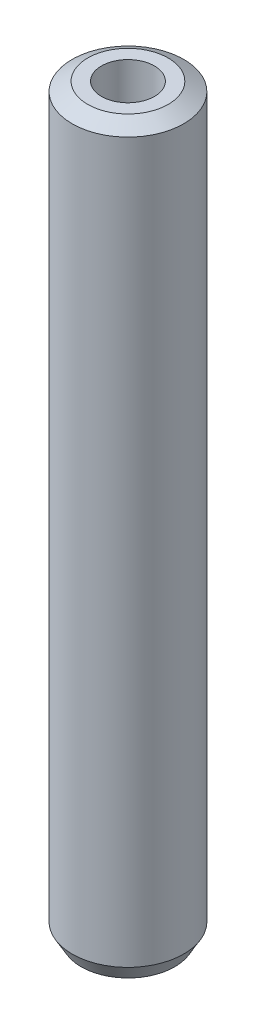
ISO-10303-21;
HEADER;
FILE_DESCRIPTION(('STEP AP214'),'2;1');
FILE_NAME('part.step','',(''),(''),'','','');
FILE_SCHEMA(('AUTOMOTIVE_DESIGN { 1 0 10303 214 1 1 1 1 }'));
ENDSEC;
DATA;
#1=APPLICATION_CONTEXT('core data for automotive mechanical design processes');
#2=APPLICATION_PROTOCOL_DEFINITION('international standard','automotive_design',2000,#1);
#3=PRODUCT_CONTEXT('',#1,'mechanical');
#4=PRODUCT('Part','Part','',(#3));
#5=PRODUCT_RELATED_PRODUCT_CATEGORY('part','',(#4));
#6=PRODUCT_DEFINITION_FORMATION('','',#4);
#7=PRODUCT_DEFINITION_CONTEXT('part definition',#1,'design');
#8=PRODUCT_DEFINITION('design','',#6,#7);
#9=PRODUCT_DEFINITION_SHAPE('','',#8);
#10=(LENGTH_UNIT() NAMED_UNIT(*) SI_UNIT(.MILLI.,.METRE.));
#11=(NAMED_UNIT(*) PLANE_ANGLE_UNIT() SI_UNIT($,.RADIAN.));
#12=(NAMED_UNIT(*) SI_UNIT($,.STERADIAN.) SOLID_ANGLE_UNIT());
#13=UNCERTAINTY_MEASURE_WITH_UNIT(LENGTH_MEASURE(1.E-05),#10,'distance_accuracy_value','');
#14=(GEOMETRIC_REPRESENTATION_CONTEXT(3) GLOBAL_UNCERTAINTY_ASSIGNED_CONTEXT((#13)) GLOBAL_UNIT_ASSIGNED_CONTEXT((#10,
#11,#12)) REPRESENTATION_CONTEXT('',''));
#15=CARTESIAN_POINT('',(0.,0.,0.));
#16=DIRECTION('',(0.,0.,1.));
#17=DIRECTION('',(1.,0.,0.));
#18=AXIS2_PLACEMENT_3D('',#15,#16,#17);
#19=CARTESIAN_POINT('',(0.,266.459598618983,0.));
#20=DIRECTION('',(0.,-1.,0.));
#21=DIRECTION('',(0.,0.,-1.));
#22=AXIS2_PLACEMENT_3D('',#19,#20,#21);
#23=CYLINDRICAL_SURFACE('',#22,20.);
#24=CARTESIAN_POINT('',(0.,263.23712569096,0.));
#25=DIRECTION('',(0.,1.,0.));
#26=DIRECTION('',(0.,0.,1.));
#27=AXIS2_PLACEMENT_3D('',#24,#25,#26);
#28=CIRCLE('',#27,20.);
#29=CARTESIAN_POINT('',(0.,263.23712569096,20.));
#30=VERTEX_POINT('',#29);
#31=EDGE_CURVE('E50',#30,#30,#28,.F.);
#32=ORIENTED_EDGE('',*,*,#31,.T.);
#33=EDGE_LOOP('',(#32));
#34=FACE_BOUND('',#33,.T.);
#35=CARTESIAN_POINT('',(0.,5.5814868373516,0.));
#36=DIRECTION('',(0.,1.,0.));
#37=DIRECTION('',(0.,0.,1.));
#38=AXIS2_PLACEMENT_3D('',#35,#36,#37);
#39=CIRCLE('',#38,20.);
#40=CARTESIAN_POINT('',(0.,5.5814868373516,20.));
#41=VERTEX_POINT('',#40);
#42=EDGE_CURVE('E51',#41,#41,#39,.T.);
#43=ORIENTED_EDGE('',*,*,#42,.T.);
#44=EDGE_LOOP('',(#43));
#45=FACE_BOUND('',#44,.T.);
#46=ADVANCED_FACE('F39',(#34,#45),#23,.T.);
#47=CARTESIAN_POINT('',(0.,266.459598618983,0.));
#48=DIRECTION('',(0.,1.,0.));
#49=DIRECTION('',(0.,0.,1.));
#50=AXIS2_PLACEMENT_3D('',#47,#48,#49);
#51=PLANE('',#50);
#52=CARTESIAN_POINT('',(0.,266.459598618983,0.));
#53=DIRECTION('',(0.,1.,0.));
#54=DIRECTION('',(0.,0.,1.));
#55=AXIS2_PLACEMENT_3D('',#52,#53,#54);
#56=CIRCLE('',#55,14.4185131626485);
#57=CARTESIAN_POINT('',(0.,266.459598618983,14.4185131626485));
#58=VERTEX_POINT('',#57);
#59=EDGE_CURVE('E54',#58,#58,#56,.T.);
#60=ORIENTED_EDGE('',*,*,#59,.T.);
#61=EDGE_LOOP('',(#60));
#62=FACE_BOUND('',#61,.T.);
#63=CARTESIAN_POINT('',(0.,266.459598618983,0.));
#64=DIRECTION('',(0.,1.,0.));
#65=DIRECTION('',(0.,0.,1.));
#66=AXIS2_PLACEMENT_3D('',#63,#64,#65);
#67=CIRCLE('',#66,9.49146868118531);
#68=CARTESIAN_POINT('',(0.,266.459598618983,9.49146868118531));
#69=VERTEX_POINT('',#68);
#70=EDGE_CURVE('E58',#69,#69,#67,.T.);
#71=ORIENTED_EDGE('',*,*,#70,.F.);
#72=EDGE_LOOP('',(#71));
#73=FACE_BOUND('',#72,.T.);
#74=ADVANCED_FACE('F69',(#62,#73),#51,.T.);
#75=CARTESIAN_POINT('',(0.,0.,0.));
#76=DIRECTION('',(0.,1.,0.));
#77=DIRECTION('',(0.,0.,1.));
#78=AXIS2_PLACEMENT_3D('',#75,#76,#77);
#79=PLANE('',#78);
#80=CARTESIAN_POINT('',(0.,0.,0.));
#81=DIRECTION('',(0.,1.,0.));
#82=DIRECTION('',(0.,0.,1.));
#83=AXIS2_PLACEMENT_3D('',#80,#81,#82);
#84=CIRCLE('',#83,16.7775270719767);
#85=CARTESIAN_POINT('',(0.,0.,16.7775270719767));
#86=VERTEX_POINT('',#85);
#87=EDGE_CURVE('E10',#86,#86,#84,.F.);
#88=ORIENTED_EDGE('',*,*,#87,.T.);
#89=EDGE_LOOP('',(#88));
#90=FACE_BOUND('',#89,.T.);
#91=CARTESIAN_POINT('',(0.,0.,0.));
#92=DIRECTION('',(0.,1.,0.));
#93=DIRECTION('',(0.,0.,1.));
#94=AXIS2_PLACEMENT_3D('',#91,#92,#93);
#95=CIRCLE('',#94,9.49146868118531);
#96=CARTESIAN_POINT('',(0.,0.,9.49146868118531));
#97=VERTEX_POINT('',#96);
#98=EDGE_CURVE('E63',#97,#97,#95,.T.);
#99=ORIENTED_EDGE('',*,*,#98,.T.);
#100=EDGE_LOOP('',(#99));
#101=FACE_BOUND('',#100,.T.);
#102=ADVANCED_FACE('F75',(#90,#101),#79,.F.);
#103=CARTESIAN_POINT('',(0.,266.459598618983,0.));
#104=DIRECTION('',(0.,-1.,0.));
#105=DIRECTION('',(0.,0.,-1.));
#106=AXIS2_PLACEMENT_3D('',#103,#104,#105);
#107=CYLINDRICAL_SURFACE('',#106,9.49146868118531);
#108=ORIENTED_EDGE('',*,*,#70,.T.);
#109=EDGE_LOOP('',(#108));
#110=FACE_BOUND('',#109,.T.);
#111=ORIENTED_EDGE('',*,*,#98,.F.);
#112=EDGE_LOOP('',(#111));
#113=FACE_BOUND('',#112,.T.);
#114=ADVANCED_FACE('F70',(#110,#113),#107,.F.);
#115=CARTESIAN_POINT('',(0.,266.459598618983,0.));
#116=DIRECTION('',(0.,-1.,0.));
#117=DIRECTION('',(0.,0.,-1.));
#118=AXIS2_PLACEMENT_3D('',#115,#116,#117);
#119=CONICAL_SURFACE('',#118,14.4185131626485,1.04719755119659);
#120=ORIENTED_EDGE('',*,*,#31,.F.);
#121=EDGE_LOOP('',(#120));
#122=FACE_BOUND('',#121,.T.);
#123=ORIENTED_EDGE('',*,*,#59,.F.);
#124=EDGE_LOOP('',(#123));
#125=FACE_BOUND('',#124,.T.);
#126=ADVANCED_FACE('F81',(#122,#125),#119,.T.);
#127=CARTESIAN_POINT('',(0.,5.5814868373516,0.));
#128=DIRECTION('',(0.,1.,0.));
#129=DIRECTION('',(0.,0.,1.));
#130=AXIS2_PLACEMENT_3D('',#127,#128,#129);
#131=CONICAL_SURFACE('',#130,20.,0.523598775598302);
#132=ORIENTED_EDGE('',*,*,#87,.F.);
#133=EDGE_LOOP('',(#132));
#134=FACE_BOUND('',#133,.T.);
#135=ORIENTED_EDGE('',*,*,#42,.F.);
#136=EDGE_LOOP('',(#135));
#137=FACE_BOUND('',#136,.T.);
#138=ADVANCED_FACE('F45',(#134,#137),#131,.T.);
#139=CLOSED_SHELL('',(#46,#74,#102,#114,#126,#138));
#140=MANIFOLD_SOLID_BREP('B2',#139);
#141=ADVANCED_BREP_SHAPE_REPRESENTATION('',(#18,#140),#14);
#142=SHAPE_DEFINITION_REPRESENTATION(#9,#141);
ENDSEC;
END-ISO-10303-21;
